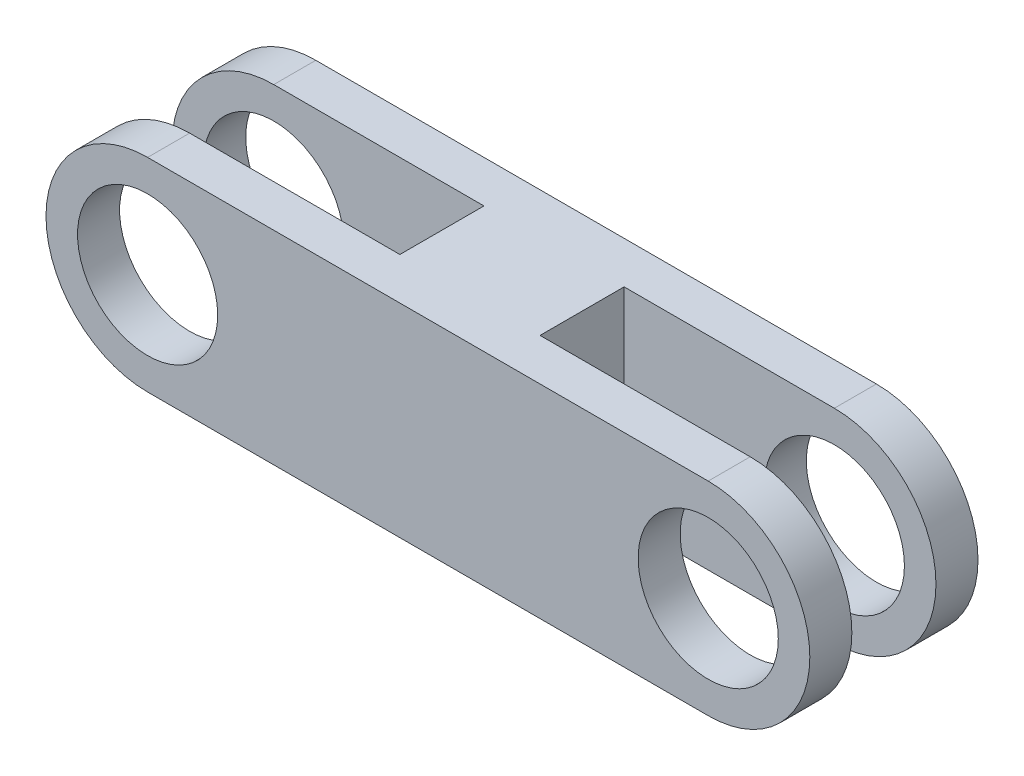
ISO-10303-21;
HEADER;
FILE_DESCRIPTION(('STEP AP214'),'2;1');
FILE_NAME('part.step','',(''),(''),'','','');
FILE_SCHEMA(('AUTOMOTIVE_DESIGN { 1 0 10303 214 1 1 1 1 }'));
ENDSEC;
DATA;
#1=APPLICATION_CONTEXT('core data for automotive mechanical design processes');
#2=APPLICATION_PROTOCOL_DEFINITION('international standard','automotive_design',2000,#1);
#3=PRODUCT_CONTEXT('',#1,'mechanical');
#4=PRODUCT('Part','Part','',(#3));
#5=PRODUCT_RELATED_PRODUCT_CATEGORY('part','',(#4));
#6=PRODUCT_DEFINITION_FORMATION('','',#4);
#7=PRODUCT_DEFINITION_CONTEXT('part definition',#1,'design');
#8=PRODUCT_DEFINITION('design','',#6,#7);
#9=PRODUCT_DEFINITION_SHAPE('','',#8);
#10=(LENGTH_UNIT() NAMED_UNIT(*) SI_UNIT(.MILLI.,.METRE.));
#11=(NAMED_UNIT(*) PLANE_ANGLE_UNIT() SI_UNIT($,.RADIAN.));
#12=(NAMED_UNIT(*) SI_UNIT($,.STERADIAN.) SOLID_ANGLE_UNIT());
#13=UNCERTAINTY_MEASURE_WITH_UNIT(LENGTH_MEASURE(1.E-05),#10,'distance_accuracy_value','');
#14=(GEOMETRIC_REPRESENTATION_CONTEXT(3) GLOBAL_UNCERTAINTY_ASSIGNED_CONTEXT((#13)) GLOBAL_UNIT_ASSIGNED_CONTEXT((#10,
#11,#12)) REPRESENTATION_CONTEXT('',''));
#15=CARTESIAN_POINT('',(0.,0.,0.));
#16=DIRECTION('',(0.,0.,1.));
#17=DIRECTION('',(1.,0.,0.));
#18=AXIS2_PLACEMENT_3D('',#15,#16,#17);
#19=CARTESIAN_POINT('',(40.,0.,0.));
#20=DIRECTION('',(0.,0.,1.));
#21=DIRECTION('',(1.,0.,0.));
#22=AXIS2_PLACEMENT_3D('',#19,#20,#21);
#23=PLANE('',#22);
#24=CARTESIAN_POINT('',(-40.,0.,0.));
#25=DIRECTION('',(0.,0.,1.));
#26=DIRECTION('',(1.,0.,0.));
#27=AXIS2_PLACEMENT_3D('',#24,#25,#26);
#28=CIRCLE('',#27,10.);
#29=CARTESIAN_POINT('',(-30.,0.,0.));
#30=VERTEX_POINT('',#29);
#31=EDGE_CURVE('E195',#30,#30,#28,.T.);
#32=ORIENTED_EDGE('',*,*,#31,.T.);
#33=EDGE_LOOP('',(#32));
#34=FACE_BOUND('',#33,.T.);
#35=DIRECTION('',(-1.,0.,0.));
#36=VECTOR('',#35,1.);
#37=CARTESIAN_POINT('',(40.,14.5,0.));
#38=LINE('',#37,#36);
#39=CARTESIAN_POINT('',(-10.,14.5,0.));
#40=VERTEX_POINT('',#39);
#41=CARTESIAN_POINT('',(-40.,14.5,0.));
#42=VERTEX_POINT('',#41);
#43=EDGE_CURVE('E225',#40,#42,#38,.T.);
#44=ORIENTED_EDGE('',*,*,#43,.F.);
#45=DIRECTION('',(0.,-1.,0.));
#46=VECTOR('',#45,1.);
#47=CARTESIAN_POINT('',(-10.,0.,0.));
#48=LINE('',#47,#46);
#49=CARTESIAN_POINT('',(-10.,-14.5,0.));
#50=VERTEX_POINT('',#49);
#51=EDGE_CURVE('E186',#40,#50,#48,.T.);
#52=ORIENTED_EDGE('',*,*,#51,.T.);
#53=DIRECTION('',(1.,0.,0.));
#54=VECTOR('',#53,1.);
#55=CARTESIAN_POINT('',(40.,-14.5,0.));
#56=LINE('',#55,#54);
#57=CARTESIAN_POINT('',(-40.,-14.5,0.));
#58=VERTEX_POINT('',#57);
#59=EDGE_CURVE('E212',#58,#50,#56,.T.);
#60=ORIENTED_EDGE('',*,*,#59,.F.);
#61=CARTESIAN_POINT('',(-40.,0.,0.));
#62=DIRECTION('',(0.,0.,1.));
#63=DIRECTION('',(1.,0.,0.));
#64=AXIS2_PLACEMENT_3D('',#61,#62,#63);
#65=CIRCLE('',#64,14.5);
#66=EDGE_CURVE('E229',#42,#58,#65,.T.);
#67=ORIENTED_EDGE('',*,*,#66,.F.);
#68=EDGE_LOOP('',(#44,#52,#60,#67));
#69=FACE_BOUND('',#68,.T.);
#70=ADVANCED_FACE('F39',(#34,#69),#23,.F.);
#71=CARTESIAN_POINT('',(40.,0.,6.));
#72=DIRECTION('',(0.,0.,1.));
#73=DIRECTION('',(1.,0.,0.));
#74=AXIS2_PLACEMENT_3D('',#71,#72,#73);
#75=PLANE('',#74);
#76=DIRECTION('',(-1.,0.,0.));
#77=VECTOR('',#76,1.);
#78=CARTESIAN_POINT('',(40.,14.5,6.));
#79=LINE('',#78,#77);
#80=CARTESIAN_POINT('',(40.,14.5,6.));
#81=VERTEX_POINT('',#80);
#82=CARTESIAN_POINT('',(-40.,14.5,6.));
#83=VERTEX_POINT('',#82);
#84=EDGE_CURVE('E211',#81,#83,#79,.T.);
#85=ORIENTED_EDGE('',*,*,#84,.T.);
#86=CARTESIAN_POINT('',(-40.,0.,6.));
#87=DIRECTION('',(0.,0.,1.));
#88=DIRECTION('',(1.,0.,0.));
#89=AXIS2_PLACEMENT_3D('',#86,#87,#88);
#90=CIRCLE('',#89,14.5);
#91=CARTESIAN_POINT('',(-40.,-14.5,6.));
#92=VERTEX_POINT('',#91);
#93=EDGE_CURVE('E215',#83,#92,#90,.T.);
#94=ORIENTED_EDGE('',*,*,#93,.T.);
#95=DIRECTION('',(1.,0.,0.));
#96=VECTOR('',#95,1.);
#97=CARTESIAN_POINT('',(40.,-14.5,6.));
#98=LINE('',#97,#96);
#99=CARTESIAN_POINT('',(40.,-14.5,6.));
#100=VERTEX_POINT('',#99);
#101=EDGE_CURVE('E218',#92,#100,#98,.T.);
#102=ORIENTED_EDGE('',*,*,#101,.T.);
#103=CARTESIAN_POINT('',(40.,0.,6.));
#104=DIRECTION('',(0.,0.,1.));
#105=DIRECTION('',(1.,0.,0.));
#106=AXIS2_PLACEMENT_3D('',#103,#104,#105);
#107=CIRCLE('',#106,14.5);
#108=EDGE_CURVE('E207',#100,#81,#107,.T.);
#109=ORIENTED_EDGE('',*,*,#108,.T.);
#110=EDGE_LOOP('',(#85,#94,#102,#109));
#111=FACE_BOUND('',#110,.T.);
#112=CARTESIAN_POINT('',(40.,0.,6.));
#113=DIRECTION('',(0.,0.,1.));
#114=DIRECTION('',(1.,0.,0.));
#115=AXIS2_PLACEMENT_3D('',#112,#113,#114);
#116=CIRCLE('',#115,10.);
#117=CARTESIAN_POINT('',(50.,0.,6.));
#118=VERTEX_POINT('',#117);
#119=EDGE_CURVE('E191',#118,#118,#116,.T.);
#120=ORIENTED_EDGE('',*,*,#119,.F.);
#121=EDGE_LOOP('',(#120));
#122=FACE_BOUND('',#121,.T.);
#123=CARTESIAN_POINT('',(-40.,0.,6.));
#124=DIRECTION('',(0.,0.,1.));
#125=DIRECTION('',(1.,0.,0.));
#126=AXIS2_PLACEMENT_3D('',#123,#124,#125);
#127=CIRCLE('',#126,10.);
#128=CARTESIAN_POINT('',(-30.,0.,6.));
#129=VERTEX_POINT('',#128);
#130=EDGE_CURVE('E199',#129,#129,#127,.T.);
#131=ORIENTED_EDGE('',*,*,#130,.F.);
#132=EDGE_LOOP('',(#131));
#133=FACE_BOUND('',#132,.T.);
#134=ADVANCED_FACE('F275',(#111,#122,#133),#75,.T.);
#135=CARTESIAN_POINT('',(10.,-14.5,0.));
#136=VERTEX_POINT('',#135);
#137=CARTESIAN_POINT('',(40.,-14.5,0.));
#138=VERTEX_POINT('',#137);
#139=EDGE_CURVE('E232',#136,#138,#56,.T.);
#140=ORIENTED_EDGE('',*,*,#139,.F.);
#141=DIRECTION('',(0.,1.,0.));
#142=VECTOR('',#141,1.);
#143=CARTESIAN_POINT('',(10.,0.,0.));
#144=LINE('',#143,#142);
#145=CARTESIAN_POINT('',(10.,14.5,0.));
#146=VERTEX_POINT('',#145);
#147=EDGE_CURVE('E176',#136,#146,#144,.T.);
#148=ORIENTED_EDGE('',*,*,#147,.T.);
#149=CARTESIAN_POINT('',(40.,14.5,0.));
#150=VERTEX_POINT('',#149);
#151=EDGE_CURVE('E226',#150,#146,#38,.T.);
#152=ORIENTED_EDGE('',*,*,#151,.F.);
#153=CARTESIAN_POINT('',(40.,0.,0.));
#154=DIRECTION('',(0.,0.,1.));
#155=DIRECTION('',(1.,0.,0.));
#156=AXIS2_PLACEMENT_3D('',#153,#154,#155);
#157=CIRCLE('',#156,14.5);
#158=EDGE_CURVE('E203',#138,#150,#157,.T.);
#159=ORIENTED_EDGE('',*,*,#158,.F.);
#160=EDGE_LOOP('',(#140,#148,#152,#159));
#161=FACE_BOUND('',#160,.T.);
#162=CARTESIAN_POINT('',(40.,0.,0.));
#163=DIRECTION('',(0.,0.,1.));
#164=DIRECTION('',(1.,0.,0.));
#165=AXIS2_PLACEMENT_3D('',#162,#163,#164);
#166=CIRCLE('',#165,10.);
#167=CARTESIAN_POINT('',(50.,0.,0.));
#168=VERTEX_POINT('',#167);
#169=EDGE_CURVE('E190',#168,#168,#166,.T.);
#170=ORIENTED_EDGE('',*,*,#169,.T.);
#171=EDGE_LOOP('',(#170));
#172=FACE_BOUND('',#171,.T.);
#173=ADVANCED_FACE('F256',(#161,#172),#23,.F.);
#174=CARTESIAN_POINT('',(40.,0.,6.));
#175=DIRECTION('',(0.,0.,-1.));
#176=DIRECTION('',(-1.,0.,0.));
#177=AXIS2_PLACEMENT_3D('',#174,#175,#176);
#178=CYLINDRICAL_SURFACE('',#177,14.5);
#179=ORIENTED_EDGE('',*,*,#158,.T.);
#180=DIRECTION('',(0.,0.,-1.));
#181=VECTOR('',#180,1.);
#182=CARTESIAN_POINT('',(40.,14.5,6.));
#183=LINE('',#182,#181);
#184=EDGE_CURVE('E48',#81,#150,#183,.T.);
#185=ORIENTED_EDGE('',*,*,#184,.F.);
#186=ORIENTED_EDGE('',*,*,#108,.F.);
#187=DIRECTION('',(0.,0.,-1.));
#188=VECTOR('',#187,1.);
#189=CARTESIAN_POINT('',(40.,-14.5,6.));
#190=LINE('',#189,#188);
#191=EDGE_CURVE('E221',#100,#138,#190,.T.);
#192=ORIENTED_EDGE('',*,*,#191,.T.);
#193=EDGE_LOOP('',(#179,#185,#186,#192));
#194=FACE_BOUND('',#193,.T.);
#195=ADVANCED_FACE('F41',(#194),#178,.T.);
#196=CARTESIAN_POINT('',(40.,14.5,6.));
#197=DIRECTION('',(0.,-1.,0.));
#198=DIRECTION('',(1.,0.,0.));
#199=AXIS2_PLACEMENT_3D('',#196,#197,#198);
#200=PLANE('',#199);
#201=DIRECTION('',(0.,0.,-1.));
#202=VECTOR('',#201,1.);
#203=CARTESIAN_POINT('',(10.,14.5,6.));
#204=LINE('',#203,#202);
#205=CARTESIAN_POINT('',(10.,14.5,-12.));
#206=VERTEX_POINT('',#205);
#207=EDGE_CURVE('E134',#146,#206,#204,.T.);
#208=ORIENTED_EDGE('',*,*,#207,.T.);
#209=DIRECTION('',(-1.,0.,0.));
#210=VECTOR('',#209,1.);
#211=CARTESIAN_POINT('',(40.,14.5,-12.));
#212=LINE('',#211,#210);
#213=CARTESIAN_POINT('',(40.,14.5,-12.));
#214=VERTEX_POINT('',#213);
#215=EDGE_CURVE('E127',#214,#206,#212,.T.);
#216=ORIENTED_EDGE('',*,*,#215,.F.);
#217=DIRECTION('',(0.,0.,-1.));
#218=VECTOR('',#217,1.);
#219=CARTESIAN_POINT('',(40.,14.5,-12.));
#220=LINE('',#219,#218);
#221=CARTESIAN_POINT('',(40.,14.5,-18.));
#222=VERTEX_POINT('',#221);
#223=EDGE_CURVE('E131',#214,#222,#220,.T.);
#224=ORIENTED_EDGE('',*,*,#223,.T.);
#225=DIRECTION('',(-1.,0.,0.));
#226=VECTOR('',#225,1.);
#227=CARTESIAN_POINT('',(-10.,14.5,-18.));
#228=LINE('',#227,#226);
#229=CARTESIAN_POINT('',(-40.,14.5,-18.));
#230=VERTEX_POINT('',#229);
#231=EDGE_CURVE('E169',#222,#230,#228,.T.);
#232=ORIENTED_EDGE('',*,*,#231,.T.);
#233=DIRECTION('',(0.,0.,-1.));
#234=VECTOR('',#233,1.);
#235=CARTESIAN_POINT('',(-40.,14.5,-12.));
#236=LINE('',#235,#234);
#237=CARTESIAN_POINT('',(-40.,14.5,-12.));
#238=VERTEX_POINT('',#237);
#239=EDGE_CURVE('E155',#238,#230,#236,.T.);
#240=ORIENTED_EDGE('',*,*,#239,.F.);
#241=CARTESIAN_POINT('',(-10.,14.5,-12.));
#242=VERTEX_POINT('',#241);
#243=EDGE_CURVE('E139',#242,#238,#212,.T.);
#244=ORIENTED_EDGE('',*,*,#243,.F.);
#245=DIRECTION('',(0.,0.,1.));
#246=VECTOR('',#245,1.);
#247=CARTESIAN_POINT('',(-10.,14.5,6.));
#248=LINE('',#247,#246);
#249=EDGE_CURVE('E159',#242,#40,#248,.T.);
#250=ORIENTED_EDGE('',*,*,#249,.T.);
#251=ORIENTED_EDGE('',*,*,#43,.T.);
#252=DIRECTION('',(0.,0.,-1.));
#253=VECTOR('',#252,1.);
#254=CARTESIAN_POINT('',(-40.,14.5,6.));
#255=LINE('',#254,#253);
#256=EDGE_CURVE('E243',#83,#42,#255,.T.);
#257=ORIENTED_EDGE('',*,*,#256,.F.);
#258=ORIENTED_EDGE('',*,*,#84,.F.);
#259=ORIENTED_EDGE('',*,*,#184,.T.);
#260=ORIENTED_EDGE('',*,*,#151,.T.);
#261=EDGE_LOOP('',(#208,#216,#224,#232,#240,#244,#250,#251,#257,#258,#259,#260));
#262=FACE_BOUND('',#261,.T.);
#263=ADVANCED_FACE('F129',(#262),#200,.F.);
#264=CARTESIAN_POINT('',(-40.,0.,6.));
#265=DIRECTION('',(0.,0.,-1.));
#266=DIRECTION('',(-1.,0.,0.));
#267=AXIS2_PLACEMENT_3D('',#264,#265,#266);
#268=CYLINDRICAL_SURFACE('',#267,14.5);
#269=ORIENTED_EDGE('',*,*,#66,.T.);
#270=DIRECTION('',(0.,0.,-1.));
#271=VECTOR('',#270,1.);
#272=CARTESIAN_POINT('',(-40.,-14.5,6.));
#273=LINE('',#272,#271);
#274=EDGE_CURVE('E239',#92,#58,#273,.T.);
#275=ORIENTED_EDGE('',*,*,#274,.F.);
#276=ORIENTED_EDGE('',*,*,#93,.F.);
#277=ORIENTED_EDGE('',*,*,#256,.T.);
#278=EDGE_LOOP('',(#269,#275,#276,#277));
#279=FACE_BOUND('',#278,.T.);
#280=ADVANCED_FACE('F292',(#279),#268,.T.);
#281=CARTESIAN_POINT('',(40.,-14.5,6.));
#282=DIRECTION('',(0.,1.,0.));
#283=DIRECTION('',(-1.,0.,0.));
#284=AXIS2_PLACEMENT_3D('',#281,#282,#283);
#285=PLANE('',#284);
#286=DIRECTION('',(0.,0.,-1.));
#287=VECTOR('',#286,1.);
#288=CARTESIAN_POINT('',(-10.,-14.5,6.));
#289=LINE('',#288,#287);
#290=CARTESIAN_POINT('',(-10.,-14.5,-12.));
#291=VERTEX_POINT('',#290);
#292=EDGE_CURVE('E172',#50,#291,#289,.T.);
#293=ORIENTED_EDGE('',*,*,#292,.T.);
#294=DIRECTION('',(1.,0.,0.));
#295=VECTOR('',#294,1.);
#296=CARTESIAN_POINT('',(40.,-14.5,-12.));
#297=LINE('',#296,#295);
#298=CARTESIAN_POINT('',(-40.,-14.5,-12.));
#299=VERTEX_POINT('',#298);
#300=EDGE_CURVE('E308',#299,#291,#297,.T.);
#301=ORIENTED_EDGE('',*,*,#300,.F.);
#302=DIRECTION('',(0.,0.,-1.));
#303=VECTOR('',#302,1.);
#304=CARTESIAN_POINT('',(-40.,-14.5,-12.));
#305=LINE('',#304,#303);
#306=CARTESIAN_POINT('',(-40.,-14.5,-18.));
#307=VERTEX_POINT('',#306);
#308=EDGE_CURVE('E162',#299,#307,#305,.T.);
#309=ORIENTED_EDGE('',*,*,#308,.T.);
#310=DIRECTION('',(1.,0.,0.));
#311=VECTOR('',#310,1.);
#312=CARTESIAN_POINT('',(-10.,-14.5,-18.));
#313=LINE('',#312,#311);
#314=CARTESIAN_POINT('',(40.,-14.5,-18.));
#315=VERTEX_POINT('',#314);
#316=EDGE_CURVE('E168',#307,#315,#313,.T.);
#317=ORIENTED_EDGE('',*,*,#316,.T.);
#318=DIRECTION('',(0.,0.,-1.));
#319=VECTOR('',#318,1.);
#320=CARTESIAN_POINT('',(40.,-14.5,-12.));
#321=LINE('',#320,#319);
#322=CARTESIAN_POINT('',(40.,-14.5,-12.));
#323=VERTEX_POINT('',#322);
#324=EDGE_CURVE('E434',#323,#315,#321,.T.);
#325=ORIENTED_EDGE('',*,*,#324,.F.);
#326=CARTESIAN_POINT('',(10.,-14.5,-12.));
#327=VERTEX_POINT('',#326);
#328=EDGE_CURVE('E55',#327,#323,#297,.T.);
#329=ORIENTED_EDGE('',*,*,#328,.F.);
#330=DIRECTION('',(0.,0.,1.));
#331=VECTOR('',#330,1.);
#332=CARTESIAN_POINT('',(10.,-14.5,6.));
#333=LINE('',#332,#331);
#334=EDGE_CURVE('E59',#327,#136,#333,.T.);
#335=ORIENTED_EDGE('',*,*,#334,.T.);
#336=ORIENTED_EDGE('',*,*,#139,.T.);
#337=ORIENTED_EDGE('',*,*,#191,.F.);
#338=ORIENTED_EDGE('',*,*,#101,.F.);
#339=ORIENTED_EDGE('',*,*,#274,.T.);
#340=ORIENTED_EDGE('',*,*,#59,.T.);
#341=EDGE_LOOP('',(#293,#301,#309,#317,#325,#329,#335,#336,#337,#338,#339,#340));
#342=FACE_BOUND('',#341,.T.);
#343=ADVANCED_FACE('F296',(#342),#285,.F.);
#344=CARTESIAN_POINT('',(-40.,0.,6.));
#345=DIRECTION('',(0.,0.,-1.));
#346=DIRECTION('',(-1.,0.,0.));
#347=AXIS2_PLACEMENT_3D('',#344,#345,#346);
#348=CYLINDRICAL_SURFACE('',#347,10.);
#349=ORIENTED_EDGE('',*,*,#130,.T.);
#350=EDGE_LOOP('',(#349));
#351=FACE_BOUND('',#350,.T.);
#352=ORIENTED_EDGE('',*,*,#31,.F.);
#353=EDGE_LOOP('',(#352));
#354=FACE_BOUND('',#353,.T.);
#355=ADVANCED_FACE('F300',(#351,#354),#348,.F.);
#356=CARTESIAN_POINT('',(40.,0.,6.));
#357=DIRECTION('',(0.,0.,-1.));
#358=DIRECTION('',(-1.,0.,0.));
#359=AXIS2_PLACEMENT_3D('',#356,#357,#358);
#360=CYLINDRICAL_SURFACE('',#359,10.);
#361=ORIENTED_EDGE('',*,*,#119,.T.);
#362=EDGE_LOOP('',(#361));
#363=FACE_BOUND('',#362,.T.);
#364=ORIENTED_EDGE('',*,*,#169,.F.);
#365=EDGE_LOOP('',(#364));
#366=FACE_BOUND('',#365,.T.);
#367=ADVANCED_FACE('F271',(#363,#366),#360,.F.);
#368=CARTESIAN_POINT('',(-10.,-45.7409987036266,6.));
#369=DIRECTION('',(-1.,0.,0.));
#370=DIRECTION('',(0.,-1.,0.));
#371=AXIS2_PLACEMENT_3D('',#368,#369,#370);
#372=PLANE('',#371);
#373=DIRECTION('',(0.,1.,0.));
#374=VECTOR('',#373,1.);
#375=CARTESIAN_POINT('',(-10.,-45.7409987036266,-12.));
#376=LINE('',#375,#374);
#377=EDGE_CURVE('E154',#291,#242,#376,.T.);
#378=ORIENTED_EDGE('',*,*,#377,.F.);
#379=ORIENTED_EDGE('',*,*,#292,.F.);
#380=ORIENTED_EDGE('',*,*,#51,.F.);
#381=ORIENTED_EDGE('',*,*,#249,.F.);
#382=EDGE_LOOP('',(#378,#379,#380,#381));
#383=FACE_BOUND('',#382,.T.);
#384=ADVANCED_FACE('F262',(#383),#372,.T.);
#385=CARTESIAN_POINT('',(10.,-45.7409987036266,6.));
#386=DIRECTION('',(1.,0.,0.));
#387=DIRECTION('',(0.,1.,0.));
#388=AXIS2_PLACEMENT_3D('',#385,#386,#387);
#389=PLANE('',#388);
#390=DIRECTION('',(0.,-1.,0.));
#391=VECTOR('',#390,1.);
#392=CARTESIAN_POINT('',(10.,-45.7409987036266,-12.));
#393=LINE('',#392,#391);
#394=EDGE_CURVE('E11',#206,#327,#393,.T.);
#395=ORIENTED_EDGE('',*,*,#394,.F.);
#396=ORIENTED_EDGE('',*,*,#207,.F.);
#397=ORIENTED_EDGE('',*,*,#147,.F.);
#398=ORIENTED_EDGE('',*,*,#334,.F.);
#399=EDGE_LOOP('',(#395,#396,#397,#398));
#400=FACE_BOUND('',#399,.T.);
#401=ADVANCED_FACE('F259',(#400),#389,.T.);
#402=CARTESIAN_POINT('',(-10.,-45.7409987036266,-18.));
#403=DIRECTION('',(0.,0.,-1.));
#404=DIRECTION('',(-1.,0.,0.));
#405=AXIS2_PLACEMENT_3D('',#402,#403,#404);
#406=PLANE('',#405);
#407=ORIENTED_EDGE('',*,*,#316,.F.);
#408=CARTESIAN_POINT('',(-40.,0.,-18.));
#409=DIRECTION('',(0.,0.,1.));
#410=DIRECTION('',(1.,0.,0.));
#411=AXIS2_PLACEMENT_3D('',#408,#409,#410);
#412=CIRCLE('',#411,14.5);
#413=EDGE_CURVE('E148',#230,#307,#412,.T.);
#414=ORIENTED_EDGE('',*,*,#413,.F.);
#415=ORIENTED_EDGE('',*,*,#231,.F.);
#416=CARTESIAN_POINT('',(40.,0.,-18.));
#417=DIRECTION('',(0.,0.,1.));
#418=DIRECTION('',(1.,0.,0.));
#419=AXIS2_PLACEMENT_3D('',#416,#417,#418);
#420=CIRCLE('',#419,14.5);
#421=EDGE_CURVE('E152',#315,#222,#420,.T.);
#422=ORIENTED_EDGE('',*,*,#421,.F.);
#423=EDGE_LOOP('',(#407,#414,#415,#422));
#424=FACE_BOUND('',#423,.T.);
#425=CARTESIAN_POINT('',(40.,0.,-18.));
#426=DIRECTION('',(0.,0.,1.));
#427=DIRECTION('',(1.,0.,0.));
#428=AXIS2_PLACEMENT_3D('',#425,#426,#427);
#429=CIRCLE('',#428,10.);
#430=CARTESIAN_POINT('',(50.,0.,-18.));
#431=VERTEX_POINT('',#430);
#432=EDGE_CURVE('E426',#431,#431,#429,.T.);
#433=ORIENTED_EDGE('',*,*,#432,.T.);
#434=EDGE_LOOP('',(#433));
#435=FACE_BOUND('',#434,.T.);
#436=CARTESIAN_POINT('',(-40.,0.,-18.));
#437=DIRECTION('',(0.,0.,1.));
#438=DIRECTION('',(1.,0.,0.));
#439=AXIS2_PLACEMENT_3D('',#436,#437,#438);
#440=CIRCLE('',#439,10.);
#441=CARTESIAN_POINT('',(-30.,0.,-18.));
#442=VERTEX_POINT('',#441);
#443=EDGE_CURVE('E417',#442,#442,#440,.T.);
#444=ORIENTED_EDGE('',*,*,#443,.T.);
#445=EDGE_LOOP('',(#444));
#446=FACE_BOUND('',#445,.T.);
#447=ADVANCED_FACE('F261',(#424,#435,#446),#406,.T.);
#448=CARTESIAN_POINT('',(40.,0.,-12.));
#449=DIRECTION('',(0.,0.,-1.));
#450=DIRECTION('',(-1.,0.,0.));
#451=AXIS2_PLACEMENT_3D('',#448,#449,#450);
#452=CYLINDRICAL_SURFACE('',#451,10.);
#453=CARTESIAN_POINT('',(40.,0.,-12.));
#454=DIRECTION('',(0.,0.,1.));
#455=DIRECTION('',(1.,0.,0.));
#456=AXIS2_PLACEMENT_3D('',#453,#454,#455);
#457=CIRCLE('',#456,10.);
#458=CARTESIAN_POINT('',(50.,0.,-12.));
#459=VERTEX_POINT('',#458);
#460=EDGE_CURVE('E420',#459,#459,#457,.T.);
#461=ORIENTED_EDGE('',*,*,#460,.T.);
#462=EDGE_LOOP('',(#461));
#463=FACE_BOUND('',#462,.T.);
#464=ORIENTED_EDGE('',*,*,#432,.F.);
#465=EDGE_LOOP('',(#464));
#466=FACE_BOUND('',#465,.T.);
#467=ADVANCED_FACE('F268',(#463,#466),#452,.F.);
#468=CARTESIAN_POINT('',(40.,0.,-12.));
#469=DIRECTION('',(0.,0.,-1.));
#470=DIRECTION('',(-1.,0.,0.));
#471=AXIS2_PLACEMENT_3D('',#468,#469,#470);
#472=CYLINDRICAL_SURFACE('',#471,14.5);
#473=ORIENTED_EDGE('',*,*,#421,.T.);
#474=ORIENTED_EDGE('',*,*,#223,.F.);
#475=CARTESIAN_POINT('',(40.,0.,-12.));
#476=DIRECTION('',(0.,0.,1.));
#477=DIRECTION('',(1.,0.,0.));
#478=AXIS2_PLACEMENT_3D('',#475,#476,#477);
#479=CIRCLE('',#478,14.5);
#480=EDGE_CURVE('E142',#323,#214,#479,.T.);
#481=ORIENTED_EDGE('',*,*,#480,.F.);
#482=ORIENTED_EDGE('',*,*,#324,.T.);
#483=EDGE_LOOP('',(#473,#474,#481,#482));
#484=FACE_BOUND('',#483,.T.);
#485=ADVANCED_FACE('F150',(#484),#472,.T.);
#486=CARTESIAN_POINT('',(40.,0.,-12.));
#487=DIRECTION('',(0.,0.,1.));
#488=DIRECTION('',(1.,0.,0.));
#489=AXIS2_PLACEMENT_3D('',#486,#487,#488);
#490=PLANE('',#489);
#491=ORIENTED_EDGE('',*,*,#215,.T.);
#492=ORIENTED_EDGE('',*,*,#394,.T.);
#493=ORIENTED_EDGE('',*,*,#328,.T.);
#494=ORIENTED_EDGE('',*,*,#480,.T.);
#495=EDGE_LOOP('',(#491,#492,#493,#494));
#496=FACE_BOUND('',#495,.T.);
#497=ORIENTED_EDGE('',*,*,#460,.F.);
#498=EDGE_LOOP('',(#497));
#499=FACE_BOUND('',#498,.T.);
#500=ADVANCED_FACE('F143',(#496,#499),#490,.T.);
#501=CARTESIAN_POINT('',(-40.,0.,-12.));
#502=DIRECTION('',(0.,0.,1.));
#503=DIRECTION('',(1.,0.,0.));
#504=AXIS2_PLACEMENT_3D('',#501,#502,#503);
#505=CIRCLE('',#504,10.);
#506=CARTESIAN_POINT('',(-30.,0.,-12.));
#507=VERTEX_POINT('',#506);
#508=EDGE_CURVE('E414',#507,#507,#505,.T.);
#509=ORIENTED_EDGE('',*,*,#508,.F.);
#510=EDGE_LOOP('',(#509));
#511=FACE_BOUND('',#510,.T.);
#512=ORIENTED_EDGE('',*,*,#300,.T.);
#513=ORIENTED_EDGE('',*,*,#377,.T.);
#514=ORIENTED_EDGE('',*,*,#243,.T.);
#515=CARTESIAN_POINT('',(-40.,0.,-12.));
#516=DIRECTION('',(0.,0.,1.));
#517=DIRECTION('',(1.,0.,0.));
#518=AXIS2_PLACEMENT_3D('',#515,#516,#517);
#519=CIRCLE('',#518,14.5);
#520=EDGE_CURVE('E138',#238,#299,#519,.T.);
#521=ORIENTED_EDGE('',*,*,#520,.T.);
#522=EDGE_LOOP('',(#512,#513,#514,#521));
#523=FACE_BOUND('',#522,.T.);
#524=ADVANCED_FACE('F380',(#511,#523),#490,.T.);
#525=CARTESIAN_POINT('',(-40.,0.,-12.));
#526=DIRECTION('',(0.,0.,-1.));
#527=DIRECTION('',(-1.,0.,0.));
#528=AXIS2_PLACEMENT_3D('',#525,#526,#527);
#529=CYLINDRICAL_SURFACE('',#528,14.5);
#530=ORIENTED_EDGE('',*,*,#413,.T.);
#531=ORIENTED_EDGE('',*,*,#308,.F.);
#532=ORIENTED_EDGE('',*,*,#520,.F.);
#533=ORIENTED_EDGE('',*,*,#239,.T.);
#534=EDGE_LOOP('',(#530,#531,#532,#533));
#535=FACE_BOUND('',#534,.T.);
#536=ADVANCED_FACE('F389',(#535),#529,.T.);
#537=CARTESIAN_POINT('',(-40.,0.,-12.));
#538=DIRECTION('',(0.,0.,-1.));
#539=DIRECTION('',(-1.,0.,0.));
#540=AXIS2_PLACEMENT_3D('',#537,#538,#539);
#541=CYLINDRICAL_SURFACE('',#540,10.);
#542=ORIENTED_EDGE('',*,*,#508,.T.);
#543=EDGE_LOOP('',(#542));
#544=FACE_BOUND('',#543,.T.);
#545=ORIENTED_EDGE('',*,*,#443,.F.);
#546=EDGE_LOOP('',(#545));
#547=FACE_BOUND('',#546,.T.);
#548=ADVANCED_FACE('F398',(#544,#547),#541,.F.);
#549=CLOSED_SHELL('',(#70,#134,#173,#195,#263,#280,#343,#355,#367,#384,#401,#447,#467,#485,#500,
#524,#536,#548));
#550=MANIFOLD_SOLID_BREP('B2',#549);
#551=ADVANCED_BREP_SHAPE_REPRESENTATION('',(#18,#550),#14);
#552=SHAPE_DEFINITION_REPRESENTATION(#9,#551);
ENDSEC;
END-ISO-10303-21;
